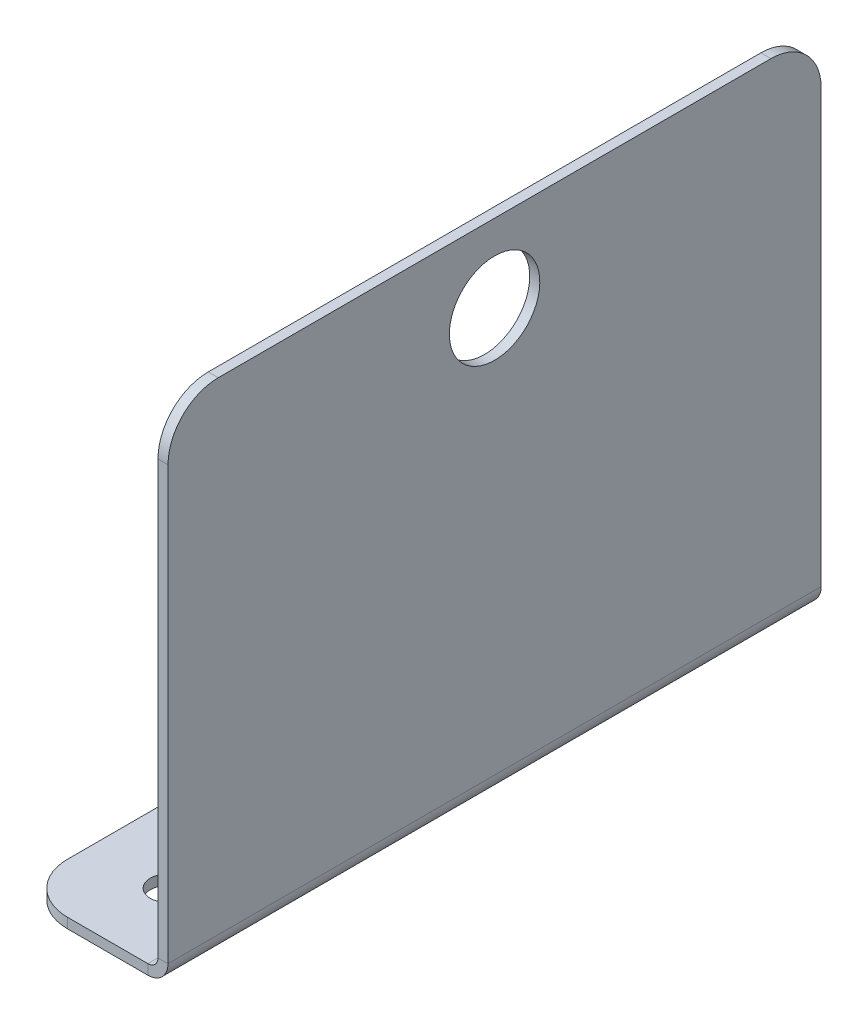
ISO-10303-21;
HEADER;
FILE_DESCRIPTION(('STEP AP214'),'2;1');
FILE_NAME('part.step','',(''),(''),'','','');
FILE_SCHEMA(('AUTOMOTIVE_DESIGN { 1 0 10303 214 1 1 1 1 }'));
ENDSEC;
DATA;
#1=APPLICATION_CONTEXT('core data for automotive mechanical design processes');
#2=APPLICATION_PROTOCOL_DEFINITION('international standard','automotive_design',2000,#1);
#3=PRODUCT_CONTEXT('',#1,'mechanical');
#4=PRODUCT('Part','Part','',(#3));
#5=PRODUCT_RELATED_PRODUCT_CATEGORY('part','',(#4));
#6=PRODUCT_DEFINITION_FORMATION('','',#4);
#7=PRODUCT_DEFINITION_CONTEXT('part definition',#1,'design');
#8=PRODUCT_DEFINITION('design','',#6,#7);
#9=PRODUCT_DEFINITION_SHAPE('','',#8);
#10=(LENGTH_UNIT() NAMED_UNIT(*) SI_UNIT(.MILLI.,.METRE.));
#11=(NAMED_UNIT(*) PLANE_ANGLE_UNIT() SI_UNIT($,.RADIAN.));
#12=(NAMED_UNIT(*) SI_UNIT($,.STERADIAN.) SOLID_ANGLE_UNIT());
#13=UNCERTAINTY_MEASURE_WITH_UNIT(LENGTH_MEASURE(1.E-05),#10,'distance_accuracy_value','');
#14=(GEOMETRIC_REPRESENTATION_CONTEXT(3) GLOBAL_UNCERTAINTY_ASSIGNED_CONTEXT((#13)) GLOBAL_UNIT_ASSIGNED_CONTEXT((#10,
#11,#12)) REPRESENTATION_CONTEXT('',''));
#15=CARTESIAN_POINT('',(0.,0.,0.));
#16=DIRECTION('',(0.,0.,1.));
#17=DIRECTION('',(1.,0.,0.));
#18=AXIS2_PLACEMENT_3D('',#15,#16,#17);
#19=CARTESIAN_POINT('',(-4.,0.,130.));
#20=DIRECTION('',(0.,0.,1.));
#21=DIRECTION('',(1.,0.,0.));
#22=AXIS2_PLACEMENT_3D('',#19,#20,#21);
#23=PLANE('',#22);
#24=DIRECTION('',(0.,1.,0.));
#25=VECTOR('',#24,1.);
#26=CARTESIAN_POINT('',(-4.,0.,130.));
#27=LINE('',#26,#25);
#28=CARTESIAN_POINT('',(-4.,0.,130.));
#29=VERTEX_POINT('',#28);
#30=CARTESIAN_POINT('',(-4.,2.,130.));
#31=VERTEX_POINT('',#30);
#32=EDGE_CURVE('E135',#29,#31,#27,.T.);
#33=ORIENTED_EDGE('',*,*,#32,.F.);
#34=CARTESIAN_POINT('',(-4.,4.,130.));
#35=DIRECTION('',(0.,0.,1.));
#36=DIRECTION('',(1.,0.,0.));
#37=AXIS2_PLACEMENT_3D('',#34,#35,#36);
#38=CIRCLE('',#37,4.);
#39=CARTESIAN_POINT('',(0.,4.,130.));
#40=VERTEX_POINT('',#39);
#41=EDGE_CURVE('E139',#40,#29,#38,.F.);
#42=ORIENTED_EDGE('',*,*,#41,.F.);
#43=DIRECTION('',(1.,0.,0.));
#44=VECTOR('',#43,1.);
#45=CARTESIAN_POINT('',(-2.,4.,130.));
#46=LINE('',#45,#44);
#47=CARTESIAN_POINT('',(-2.,4.,130.));
#48=VERTEX_POINT('',#47);
#49=EDGE_CURVE('E144',#48,#40,#46,.T.);
#50=ORIENTED_EDGE('',*,*,#49,.F.);
#51=CARTESIAN_POINT('',(-4.,4.,130.));
#52=DIRECTION('',(0.,0.,1.));
#53=DIRECTION('',(1.,0.,0.));
#54=AXIS2_PLACEMENT_3D('',#51,#52,#53);
#55=CIRCLE('',#54,2.);
#56=EDGE_CURVE('E141',#48,#31,#55,.F.);
#57=ORIENTED_EDGE('',*,*,#56,.T.);
#58=EDGE_LOOP('',(#33,#42,#50,#57));
#59=FACE_BOUND('',#58,.T.);
#60=ADVANCED_FACE('F41',(#59),#23,.T.);
#61=CARTESIAN_POINT('',(-2.,4.,130.));
#62=DIRECTION('',(0.,0.,1.));
#63=DIRECTION('',(1.,0.,0.));
#64=AXIS2_PLACEMENT_3D('',#61,#62,#63);
#65=PLANE('',#64);
#66=DIRECTION('',(1.,0.,0.));
#67=VECTOR('',#66,1.);
#68=CARTESIAN_POINT('',(0.,2.,130.));
#69=LINE('',#68,#67);
#70=CARTESIAN_POINT('',(-20.,2.,130.));
#71=VERTEX_POINT('',#70);
#72=EDGE_CURVE('E159',#31,#71,#69,.F.);
#73=ORIENTED_EDGE('',*,*,#72,.T.);
#74=DIRECTION('',(0.,1.,0.));
#75=VECTOR('',#74,1.);
#76=CARTESIAN_POINT('',(-20.,4.,130.));
#77=LINE('',#76,#75);
#78=CARTESIAN_POINT('',(-20.,0.,130.));
#79=VERTEX_POINT('',#78);
#80=EDGE_CURVE('E66',#71,#79,#77,.F.);
#81=ORIENTED_EDGE('',*,*,#80,.T.);
#82=DIRECTION('',(-1.,0.,0.));
#83=VECTOR('',#82,1.);
#84=CARTESIAN_POINT('',(0.,0.,130.));
#85=LINE('',#84,#83);
#86=EDGE_CURVE('E149',#29,#79,#85,.T.);
#87=ORIENTED_EDGE('',*,*,#86,.F.);
#88=ORIENTED_EDGE('',*,*,#32,.T.);
#89=EDGE_LOOP('',(#73,#81,#87,#88));
#90=FACE_BOUND('',#89,.T.);
#91=ADVANCED_FACE('F158',(#90),#65,.T.);
#92=CARTESIAN_POINT('',(0.,4.,0.));
#93=DIRECTION('',(0.,0.,-1.));
#94=DIRECTION('',(-1.,0.,0.));
#95=AXIS2_PLACEMENT_3D('',#92,#93,#94);
#96=PLANE('',#95);
#97=DIRECTION('',(-1.,0.,0.));
#98=VECTOR('',#97,1.);
#99=CARTESIAN_POINT('',(0.,4.,0.));
#100=LINE('',#99,#98);
#101=CARTESIAN_POINT('',(0.,4.,0.));
#102=VERTEX_POINT('',#101);
#103=CARTESIAN_POINT('',(-2.,4.,0.));
#104=VERTEX_POINT('',#103);
#105=EDGE_CURVE('E204',#102,#104,#100,.T.);
#106=ORIENTED_EDGE('',*,*,#105,.F.);
#107=CARTESIAN_POINT('',(-4.,4.,0.));
#108=DIRECTION('',(0.,0.,1.));
#109=DIRECTION('',(1.,0.,0.));
#110=AXIS2_PLACEMENT_3D('',#107,#108,#109);
#111=CIRCLE('',#110,4.);
#112=CARTESIAN_POINT('',(-4.,0.,0.));
#113=VERTEX_POINT('',#112);
#114=EDGE_CURVE('E177',#102,#113,#111,.F.);
#115=ORIENTED_EDGE('',*,*,#114,.T.);
#116=DIRECTION('',(0.,-1.,0.));
#117=VECTOR('',#116,1.);
#118=CARTESIAN_POINT('',(-4.,2.,0.));
#119=LINE('',#118,#117);
#120=CARTESIAN_POINT('',(-4.,2.,0.));
#121=VERTEX_POINT('',#120);
#122=EDGE_CURVE('E202',#121,#113,#119,.T.);
#123=ORIENTED_EDGE('',*,*,#122,.F.);
#124=CARTESIAN_POINT('',(-4.,4.,0.));
#125=DIRECTION('',(0.,0.,1.));
#126=DIRECTION('',(1.,0.,0.));
#127=AXIS2_PLACEMENT_3D('',#124,#125,#126);
#128=CIRCLE('',#127,2.);
#129=EDGE_CURVE('E183',#104,#121,#128,.F.);
#130=ORIENTED_EDGE('',*,*,#129,.F.);
#131=EDGE_LOOP('',(#106,#115,#123,#130));
#132=FACE_BOUND('',#131,.T.);
#133=ADVANCED_FACE('F278',(#132),#96,.T.);
#134=CARTESIAN_POINT('',(-4.,2.,0.));
#135=DIRECTION('',(0.,0.,-1.));
#136=DIRECTION('',(-1.,0.,0.));
#137=AXIS2_PLACEMENT_3D('',#134,#135,#136);
#138=PLANE('',#137);
#139=DIRECTION('',(0.,-1.,0.));
#140=VECTOR('',#139,1.);
#141=CARTESIAN_POINT('',(-2.00000000000001,100.,0.));
#142=LINE('',#141,#140);
#143=CARTESIAN_POINT('',(-2.00000000000001,90.,0.));
#144=VERTEX_POINT('',#143);
#145=EDGE_CURVE('E181',#144,#104,#142,.T.);
#146=ORIENTED_EDGE('',*,*,#145,.F.);
#147=DIRECTION('',(1.,0.,0.));
#148=VECTOR('',#147,1.);
#149=CARTESIAN_POINT('',(-4.,90.,0.));
#150=LINE('',#149,#148);
#151=CARTESIAN_POINT('',(0.,90.,0.));
#152=VERTEX_POINT('',#151);
#153=EDGE_CURVE('E143',#144,#152,#150,.T.);
#154=ORIENTED_EDGE('',*,*,#153,.T.);
#155=DIRECTION('',(0.,-1.,0.));
#156=VECTOR('',#155,1.);
#157=CARTESIAN_POINT('',(0.,100.,0.));
#158=LINE('',#157,#156);
#159=EDGE_CURVE('E179',#152,#102,#158,.T.);
#160=ORIENTED_EDGE('',*,*,#159,.T.);
#161=ORIENTED_EDGE('',*,*,#105,.T.);
#162=EDGE_LOOP('',(#146,#154,#160,#161));
#163=FACE_BOUND('',#162,.T.);
#164=ADVANCED_FACE('F295',(#163),#138,.T.);
#165=CARTESIAN_POINT('',(0.,2.,130.));
#166=DIRECTION('',(0.,-1.,0.));
#167=DIRECTION('',(0.,0.,-1.));
#168=AXIS2_PLACEMENT_3D('',#165,#166,#167);
#169=PLANE('',#168);
#170=CARTESIAN_POINT('',(-15.,2.,15.));
#171=DIRECTION('',(0.,1.,0.));
#172=DIRECTION('',(0.,0.,1.));
#173=AXIS2_PLACEMENT_3D('',#170,#171,#172);
#174=CIRCLE('',#173,3.5);
#175=CARTESIAN_POINT('',(-15.,2.,18.5));
#176=VERTEX_POINT('',#175);
#177=EDGE_CURVE('E240',#176,#176,#174,.T.);
#178=ORIENTED_EDGE('',*,*,#177,.F.);
#179=EDGE_LOOP('',(#178));
#180=FACE_BOUND('',#179,.T.);
#181=CARTESIAN_POINT('',(-15.,2.,115.));
#182=DIRECTION('',(0.,1.,0.));
#183=DIRECTION('',(0.,0.,1.));
#184=AXIS2_PLACEMENT_3D('',#181,#182,#183);
#185=CIRCLE('',#184,3.5);
#186=CARTESIAN_POINT('',(-15.,2.,118.5));
#187=VERTEX_POINT('',#186);
#188=EDGE_CURVE('E245',#187,#187,#185,.T.);
#189=ORIENTED_EDGE('',*,*,#188,.F.);
#190=EDGE_LOOP('',(#189));
#191=FACE_BOUND('',#190,.T.);
#192=DIRECTION('',(0.,0.,-1.));
#193=VECTOR('',#192,1.);
#194=CARTESIAN_POINT('',(-30.,2.,130.));
#195=LINE('',#194,#193);
#196=CARTESIAN_POINT('',(-30.,2.,120.));
#197=VERTEX_POINT('',#196);
#198=CARTESIAN_POINT('',(-30.,2.,9.99999999999999));
#199=VERTEX_POINT('',#198);
#200=EDGE_CURVE('E199',#197,#199,#195,.T.);
#201=ORIENTED_EDGE('',*,*,#200,.F.);
#202=CARTESIAN_POINT('',(-20.,2.,120.));
#203=DIRECTION('',(0.,-1.,0.));
#204=DIRECTION('',(0.,0.,-1.));
#205=AXIS2_PLACEMENT_3D('',#202,#203,#204);
#206=CIRCLE('',#205,10.);
#207=EDGE_CURVE('E231',#197,#71,#206,.F.);
#208=ORIENTED_EDGE('',*,*,#207,.T.);
#209=ORIENTED_EDGE('',*,*,#72,.F.);
#210=DIRECTION('',(0.,0.,-1.));
#211=VECTOR('',#210,1.);
#212=CARTESIAN_POINT('',(-4.,2.,130.));
#213=LINE('',#212,#211);
#214=EDGE_CURVE('E172',#31,#121,#213,.T.);
#215=ORIENTED_EDGE('',*,*,#214,.T.);
#216=DIRECTION('',(1.,0.,0.));
#217=VECTOR('',#216,1.);
#218=CARTESIAN_POINT('',(0.,2.,0.));
#219=LINE('',#218,#217);
#220=CARTESIAN_POINT('',(-20.,2.,0.));
#221=VERTEX_POINT('',#220);
#222=EDGE_CURVE('E173',#121,#221,#219,.F.);
#223=ORIENTED_EDGE('',*,*,#222,.T.);
#224=CARTESIAN_POINT('',(-20.,2.,10.));
#225=DIRECTION('',(0.,-1.,0.));
#226=DIRECTION('',(0.,0.,-1.));
#227=AXIS2_PLACEMENT_3D('',#224,#225,#226);
#228=CIRCLE('',#227,10.);
#229=EDGE_CURVE('E229',#221,#199,#228,.F.);
#230=ORIENTED_EDGE('',*,*,#229,.T.);
#231=EDGE_LOOP('',(#201,#208,#209,#215,#223,#230));
#232=FACE_BOUND('',#231,.T.);
#233=ADVANCED_FACE('F271',(#180,#191,#232),#169,.F.);
#234=CARTESIAN_POINT('',(-30.,0.,130.));
#235=DIRECTION('',(-1.,0.,0.));
#236=DIRECTION('',(0.,0.,1.));
#237=AXIS2_PLACEMENT_3D('',#234,#235,#236);
#238=PLANE('',#237);
#239=DIRECTION('',(0.,0.,-1.));
#240=VECTOR('',#239,1.);
#241=CARTESIAN_POINT('',(-30.,0.,130.));
#242=LINE('',#241,#240);
#243=CARTESIAN_POINT('',(-30.,0.,120.));
#244=VERTEX_POINT('',#243);
#245=CARTESIAN_POINT('',(-30.,0.,9.99999999999999));
#246=VERTEX_POINT('',#245);
#247=EDGE_CURVE('E155',#244,#246,#242,.T.);
#248=ORIENTED_EDGE('',*,*,#247,.F.);
#249=DIRECTION('',(0.,1.,0.));
#250=VECTOR('',#249,1.);
#251=CARTESIAN_POINT('',(-30.,0.,120.));
#252=LINE('',#251,#250);
#253=EDGE_CURVE('E226',#244,#197,#252,.T.);
#254=ORIENTED_EDGE('',*,*,#253,.T.);
#255=ORIENTED_EDGE('',*,*,#200,.T.);
#256=DIRECTION('',(0.,1.,0.));
#257=VECTOR('',#256,1.);
#258=CARTESIAN_POINT('',(-30.,0.,10.));
#259=LINE('',#258,#257);
#260=EDGE_CURVE('E224',#199,#246,#259,.F.);
#261=ORIENTED_EDGE('',*,*,#260,.T.);
#262=EDGE_LOOP('',(#248,#254,#255,#261));
#263=FACE_BOUND('',#262,.T.);
#264=ADVANCED_FACE('F262',(#263),#238,.T.);
#265=CARTESIAN_POINT('',(0.,0.,130.));
#266=DIRECTION('',(0.,-1.,0.));
#267=DIRECTION('',(0.,0.,-1.));
#268=AXIS2_PLACEMENT_3D('',#265,#266,#267);
#269=PLANE('',#268);
#270=CARTESIAN_POINT('',(-15.,0.,15.));
#271=DIRECTION('',(0.,-1.,0.));
#272=DIRECTION('',(0.,0.,-1.));
#273=AXIS2_PLACEMENT_3D('',#270,#271,#272);
#274=CIRCLE('',#273,3.5);
#275=CARTESIAN_POINT('',(-15.,0.,11.5));
#276=VERTEX_POINT('',#275);
#277=EDGE_CURVE('E45',#276,#276,#274,.T.);
#278=ORIENTED_EDGE('',*,*,#277,.F.);
#279=EDGE_LOOP('',(#278));
#280=FACE_BOUND('',#279,.T.);
#281=CARTESIAN_POINT('',(-15.,0.,115.));
#282=DIRECTION('',(0.,-1.,0.));
#283=DIRECTION('',(0.,0.,-1.));
#284=AXIS2_PLACEMENT_3D('',#281,#282,#283);
#285=CIRCLE('',#284,3.5);
#286=CARTESIAN_POINT('',(-15.,0.,111.5));
#287=VERTEX_POINT('',#286);
#288=EDGE_CURVE('E238',#287,#287,#285,.T.);
#289=ORIENTED_EDGE('',*,*,#288,.F.);
#290=EDGE_LOOP('',(#289));
#291=FACE_BOUND('',#290,.T.);
#292=ORIENTED_EDGE('',*,*,#86,.T.);
#293=CARTESIAN_POINT('',(-20.,0.,120.));
#294=DIRECTION('',(0.,-1.,0.));
#295=DIRECTION('',(0.,0.,-1.));
#296=AXIS2_PLACEMENT_3D('',#293,#294,#295);
#297=CIRCLE('',#296,10.);
#298=EDGE_CURVE('E235',#79,#244,#297,.T.);
#299=ORIENTED_EDGE('',*,*,#298,.T.);
#300=ORIENTED_EDGE('',*,*,#247,.T.);
#301=CARTESIAN_POINT('',(-20.,0.,10.));
#302=DIRECTION('',(0.,-1.,0.));
#303=DIRECTION('',(0.,0.,-1.));
#304=AXIS2_PLACEMENT_3D('',#301,#302,#303);
#305=CIRCLE('',#304,10.);
#306=CARTESIAN_POINT('',(-20.,0.,0.));
#307=VERTEX_POINT('',#306);
#308=EDGE_CURVE('E58',#246,#307,#305,.T.);
#309=ORIENTED_EDGE('',*,*,#308,.T.);
#310=DIRECTION('',(-1.,0.,0.));
#311=VECTOR('',#310,1.);
#312=CARTESIAN_POINT('',(0.,0.,0.));
#313=LINE('',#312,#311);
#314=EDGE_CURVE('E151',#113,#307,#313,.T.);
#315=ORIENTED_EDGE('',*,*,#314,.F.);
#316=DIRECTION('',(0.,0.,-1.));
#317=VECTOR('',#316,1.);
#318=CARTESIAN_POINT('',(-4.,0.,130.));
#319=LINE('',#318,#317);
#320=EDGE_CURVE('E147',#29,#113,#319,.T.);
#321=ORIENTED_EDGE('',*,*,#320,.F.);
#322=EDGE_LOOP('',(#292,#299,#300,#309,#315,#321));
#323=FACE_BOUND('',#322,.T.);
#324=ADVANCED_FACE('F148',(#280,#291,#323),#269,.T.);
#325=CARTESIAN_POINT('',(-4.,4.,130.));
#326=DIRECTION('',(0.,0.,-1.));
#327=DIRECTION('',(-1.,0.,0.));
#328=AXIS2_PLACEMENT_3D('',#325,#326,#327);
#329=CYLINDRICAL_SURFACE('',#328,4.);
#330=ORIENTED_EDGE('',*,*,#114,.F.);
#331=DIRECTION('',(0.,0.,-1.));
#332=VECTOR('',#331,1.);
#333=CARTESIAN_POINT('',(0.,4.,130.));
#334=LINE('',#333,#332);
#335=EDGE_CURVE('E156',#40,#102,#334,.T.);
#336=ORIENTED_EDGE('',*,*,#335,.F.);
#337=ORIENTED_EDGE('',*,*,#41,.T.);
#338=ORIENTED_EDGE('',*,*,#320,.T.);
#339=EDGE_LOOP('',(#330,#336,#337,#338));
#340=FACE_BOUND('',#339,.T.);
#341=ADVANCED_FACE('F162',(#340),#329,.T.);
#342=CARTESIAN_POINT('',(0.,100.,130.));
#343=DIRECTION('',(1.,0.,0.));
#344=DIRECTION('',(0.,1.,0.));
#345=AXIS2_PLACEMENT_3D('',#342,#343,#344);
#346=PLANE('',#345);
#347=CARTESIAN_POINT('',(0.,84.4999999971944,65.));
#348=DIRECTION('',(1.,0.,0.));
#349=DIRECTION('',(0.,1.,0.));
#350=AXIS2_PLACEMENT_3D('',#347,#348,#349);
#351=CIRCLE('',#350,9.00000000000001);
#352=CARTESIAN_POINT('',(0.,93.4999999971944,65.));
#353=VERTEX_POINT('',#352);
#354=EDGE_CURVE('E253',#353,#353,#351,.T.);
#355=ORIENTED_EDGE('',*,*,#354,.F.);
#356=EDGE_LOOP('',(#355));
#357=FACE_BOUND('',#356,.T.);
#358=ORIENTED_EDGE('',*,*,#159,.F.);
#359=CARTESIAN_POINT('',(0.,90.,10.));
#360=DIRECTION('',(1.,0.,0.));
#361=DIRECTION('',(0.,1.,0.));
#362=AXIS2_PLACEMENT_3D('',#359,#360,#361);
#363=CIRCLE('',#362,10.);
#364=CARTESIAN_POINT('',(0.,100.,9.99999999999999));
#365=VERTEX_POINT('',#364);
#366=EDGE_CURVE('E213',#152,#365,#363,.T.);
#367=ORIENTED_EDGE('',*,*,#366,.T.);
#368=DIRECTION('',(0.,0.,-1.));
#369=VECTOR('',#368,1.);
#370=CARTESIAN_POINT('',(0.,100.,130.));
#371=LINE('',#370,#369);
#372=CARTESIAN_POINT('',(0.,100.,120.));
#373=VERTEX_POINT('',#372);
#374=EDGE_CURVE('E194',#373,#365,#371,.T.);
#375=ORIENTED_EDGE('',*,*,#374,.F.);
#376=CARTESIAN_POINT('',(0.,90.,120.));
#377=DIRECTION('',(1.,0.,0.));
#378=DIRECTION('',(0.,1.,0.));
#379=AXIS2_PLACEMENT_3D('',#376,#377,#378);
#380=CIRCLE('',#379,10.);
#381=CARTESIAN_POINT('',(0.,90.,130.));
#382=VERTEX_POINT('',#381);
#383=EDGE_CURVE('E211',#373,#382,#380,.T.);
#384=ORIENTED_EDGE('',*,*,#383,.T.);
#385=DIRECTION('',(0.,-1.,0.));
#386=VECTOR('',#385,1.);
#387=CARTESIAN_POINT('',(0.,100.,130.));
#388=LINE('',#387,#386);
#389=EDGE_CURVE('E164',#382,#40,#388,.T.);
#390=ORIENTED_EDGE('',*,*,#389,.T.);
#391=ORIENTED_EDGE('',*,*,#335,.T.);
#392=EDGE_LOOP('',(#358,#367,#375,#384,#390,#391));
#393=FACE_BOUND('',#392,.T.);
#394=ADVANCED_FACE('F283',(#357,#393),#346,.T.);
#395=CARTESIAN_POINT('',(-2.00000000000001,100.,130.));
#396=DIRECTION('',(0.,1.,0.));
#397=DIRECTION('',(0.,0.,1.));
#398=AXIS2_PLACEMENT_3D('',#395,#396,#397);
#399=PLANE('',#398);
#400=ORIENTED_EDGE('',*,*,#374,.T.);
#401=DIRECTION('',(1.,0.,0.));
#402=VECTOR('',#401,1.);
#403=CARTESIAN_POINT('',(-2.00000000000001,100.,9.99999999999999));
#404=LINE('',#403,#402);
#405=CARTESIAN_POINT('',(-2.00000000000001,100.,9.99999999999999));
#406=VERTEX_POINT('',#405);
#407=EDGE_CURVE('E218',#365,#406,#404,.F.);
#408=ORIENTED_EDGE('',*,*,#407,.T.);
#409=DIRECTION('',(0.,0.,-1.));
#410=VECTOR('',#409,1.);
#411=CARTESIAN_POINT('',(-2.00000000000001,100.,130.));
#412=LINE('',#411,#410);
#413=CARTESIAN_POINT('',(-2.00000000000001,100.,120.));
#414=VERTEX_POINT('',#413);
#415=EDGE_CURVE('E191',#414,#406,#412,.T.);
#416=ORIENTED_EDGE('',*,*,#415,.F.);
#417=DIRECTION('',(1.,0.,0.));
#418=VECTOR('',#417,1.);
#419=CARTESIAN_POINT('',(-2.00000000000001,100.,120.));
#420=LINE('',#419,#418);
#421=EDGE_CURVE('E215',#414,#373,#420,.T.);
#422=ORIENTED_EDGE('',*,*,#421,.T.);
#423=EDGE_LOOP('',(#400,#408,#416,#422));
#424=FACE_BOUND('',#423,.T.);
#425=ADVANCED_FACE('F300',(#424),#399,.T.);
#426=CARTESIAN_POINT('',(-2.00000000000001,100.,130.));
#427=DIRECTION('',(1.,0.,0.));
#428=DIRECTION('',(0.,1.,0.));
#429=AXIS2_PLACEMENT_3D('',#426,#427,#428);
#430=PLANE('',#429);
#431=CARTESIAN_POINT('',(-2.,84.4999999971944,65.));
#432=DIRECTION('',(1.,0.,0.));
#433=DIRECTION('',(0.,1.,0.));
#434=AXIS2_PLACEMENT_3D('',#431,#432,#433);
#435=CIRCLE('',#434,9.00000000000001);
#436=CARTESIAN_POINT('',(-2.00000000000001,93.4999999971944,65.));
#437=VERTEX_POINT('',#436);
#438=EDGE_CURVE('E250',#437,#437,#435,.T.);
#439=ORIENTED_EDGE('',*,*,#438,.T.);
#440=EDGE_LOOP('',(#439));
#441=FACE_BOUND('',#440,.T.);
#442=ORIENTED_EDGE('',*,*,#415,.T.);
#443=CARTESIAN_POINT('',(-2.00000000000001,90.,10.));
#444=DIRECTION('',(1.,0.,0.));
#445=DIRECTION('',(0.,1.,0.));
#446=AXIS2_PLACEMENT_3D('',#443,#444,#445);
#447=CIRCLE('',#446,10.);
#448=EDGE_CURVE('E222',#406,#144,#447,.F.);
#449=ORIENTED_EDGE('',*,*,#448,.T.);
#450=ORIENTED_EDGE('',*,*,#145,.T.);
#451=DIRECTION('',(0.,0.,-1.));
#452=VECTOR('',#451,1.);
#453=CARTESIAN_POINT('',(-2.,4.,130.));
#454=LINE('',#453,#452);
#455=EDGE_CURVE('E188',#48,#104,#454,.T.);
#456=ORIENTED_EDGE('',*,*,#455,.F.);
#457=DIRECTION('',(0.,-1.,0.));
#458=VECTOR('',#457,1.);
#459=CARTESIAN_POINT('',(-2.00000000000001,100.,130.));
#460=LINE('',#459,#458);
#461=CARTESIAN_POINT('',(-2.00000000000001,90.,130.));
#462=VERTEX_POINT('',#461);
#463=EDGE_CURVE('E166',#462,#48,#460,.T.);
#464=ORIENTED_EDGE('',*,*,#463,.F.);
#465=CARTESIAN_POINT('',(-2.00000000000001,90.,120.));
#466=DIRECTION('',(1.,0.,0.));
#467=DIRECTION('',(0.,1.,0.));
#468=AXIS2_PLACEMENT_3D('',#465,#466,#467);
#469=CIRCLE('',#468,10.);
#470=EDGE_CURVE('E220',#462,#414,#469,.F.);
#471=ORIENTED_EDGE('',*,*,#470,.T.);
#472=EDGE_LOOP('',(#442,#449,#450,#456,#464,#471));
#473=FACE_BOUND('',#472,.T.);
#474=ADVANCED_FACE('F291',(#441,#473),#430,.F.);
#475=CARTESIAN_POINT('',(-4.,4.,130.));
#476=DIRECTION('',(0.,0.,-1.));
#477=DIRECTION('',(-1.,0.,0.));
#478=AXIS2_PLACEMENT_3D('',#475,#476,#477);
#479=CYLINDRICAL_SURFACE('',#478,2.);
#480=ORIENTED_EDGE('',*,*,#129,.T.);
#481=ORIENTED_EDGE('',*,*,#214,.F.);
#482=ORIENTED_EDGE('',*,*,#56,.F.);
#483=ORIENTED_EDGE('',*,*,#455,.T.);
#484=EDGE_LOOP('',(#480,#481,#482,#483));
#485=FACE_BOUND('',#484,.T.);
#486=ADVANCED_FACE('F273',(#485),#479,.F.);
#487=CARTESIAN_POINT('',(-4.,4.,130.));
#488=DIRECTION('',(0.,0.,1.));
#489=DIRECTION('',(1.,0.,0.));
#490=AXIS2_PLACEMENT_3D('',#487,#488,#489);
#491=PLANE('',#490);
#492=ORIENTED_EDGE('',*,*,#389,.F.);
#493=DIRECTION('',(1.,0.,0.));
#494=VECTOR('',#493,1.);
#495=CARTESIAN_POINT('',(-4.,90.,130.));
#496=LINE('',#495,#494);
#497=EDGE_CURVE('E11',#382,#462,#496,.F.);
#498=ORIENTED_EDGE('',*,*,#497,.T.);
#499=ORIENTED_EDGE('',*,*,#463,.T.);
#500=ORIENTED_EDGE('',*,*,#49,.T.);
#501=EDGE_LOOP('',(#492,#498,#499,#500));
#502=FACE_BOUND('',#501,.T.);
#503=ADVANCED_FACE('F288',(#502),#491,.T.);
#504=CARTESIAN_POINT('',(-4.,4.,0.));
#505=DIRECTION('',(0.,0.,1.));
#506=DIRECTION('',(1.,0.,0.));
#507=AXIS2_PLACEMENT_3D('',#504,#505,#506);
#508=PLANE('',#507);
#509=ORIENTED_EDGE('',*,*,#314,.T.);
#510=DIRECTION('',(0.,1.,0.));
#511=VECTOR('',#510,1.);
#512=CARTESIAN_POINT('',(-20.,2.,0.));
#513=LINE('',#512,#511);
#514=EDGE_CURVE('E50',#307,#221,#513,.T.);
#515=ORIENTED_EDGE('',*,*,#514,.T.);
#516=ORIENTED_EDGE('',*,*,#222,.F.);
#517=ORIENTED_EDGE('',*,*,#122,.T.);
#518=EDGE_LOOP('',(#509,#515,#516,#517));
#519=FACE_BOUND('',#518,.T.);
#520=ADVANCED_FACE('F270',(#519),#508,.F.);
#521=CARTESIAN_POINT('',(-4.,90.,10.));
#522=DIRECTION('',(1.,0.,0.));
#523=DIRECTION('',(0.,0.,-1.));
#524=AXIS2_PLACEMENT_3D('',#521,#522,#523);
#525=CYLINDRICAL_SURFACE('',#524,10.);
#526=ORIENTED_EDGE('',*,*,#448,.F.);
#527=ORIENTED_EDGE('',*,*,#407,.F.);
#528=ORIENTED_EDGE('',*,*,#366,.F.);
#529=ORIENTED_EDGE('',*,*,#153,.F.);
#530=EDGE_LOOP('',(#526,#527,#528,#529));
#531=FACE_BOUND('',#530,.T.);
#532=ADVANCED_FACE('F297',(#531),#525,.T.);
#533=CARTESIAN_POINT('',(-20.,0.,120.));
#534=DIRECTION('',(0.,1.,0.));
#535=DIRECTION('',(0.,0.,1.));
#536=AXIS2_PLACEMENT_3D('',#533,#534,#535);
#537=CYLINDRICAL_SURFACE('',#536,10.);
#538=ORIENTED_EDGE('',*,*,#298,.F.);
#539=ORIENTED_EDGE('',*,*,#80,.F.);
#540=ORIENTED_EDGE('',*,*,#207,.F.);
#541=ORIENTED_EDGE('',*,*,#253,.F.);
#542=EDGE_LOOP('',(#538,#539,#540,#541));
#543=FACE_BOUND('',#542,.T.);
#544=ADVANCED_FACE('F258',(#543),#537,.T.);
#545=CARTESIAN_POINT('',(-20.,4.,10.));
#546=DIRECTION('',(0.,-1.,0.));
#547=DIRECTION('',(0.,0.,-1.));
#548=AXIS2_PLACEMENT_3D('',#545,#546,#547);
#549=CYLINDRICAL_SURFACE('',#548,10.);
#550=ORIENTED_EDGE('',*,*,#308,.F.);
#551=ORIENTED_EDGE('',*,*,#260,.F.);
#552=ORIENTED_EDGE('',*,*,#229,.F.);
#553=ORIENTED_EDGE('',*,*,#514,.F.);
#554=EDGE_LOOP('',(#550,#551,#552,#553));
#555=FACE_BOUND('',#554,.T.);
#556=ADVANCED_FACE('F266',(#555),#549,.T.);
#557=CARTESIAN_POINT('',(-2.00000000000001,90.,120.));
#558=DIRECTION('',(1.,0.,0.));
#559=DIRECTION('',(0.,0.,-1.));
#560=AXIS2_PLACEMENT_3D('',#557,#558,#559);
#561=CYLINDRICAL_SURFACE('',#560,10.);
#562=ORIENTED_EDGE('',*,*,#470,.F.);
#563=ORIENTED_EDGE('',*,*,#497,.F.);
#564=ORIENTED_EDGE('',*,*,#383,.F.);
#565=ORIENTED_EDGE('',*,*,#421,.F.);
#566=EDGE_LOOP('',(#562,#563,#564,#565));
#567=FACE_BOUND('',#566,.T.);
#568=ADVANCED_FACE('F43',(#567),#561,.T.);
#569=CARTESIAN_POINT('',(-15.,-8.,115.));
#570=DIRECTION('',(0.,1.,0.));
#571=DIRECTION('',(0.,0.,1.));
#572=AXIS2_PLACEMENT_3D('',#569,#570,#571);
#573=CYLINDRICAL_SURFACE('',#572,3.5);
#574=ORIENTED_EDGE('',*,*,#288,.T.);
#575=EDGE_LOOP('',(#574));
#576=FACE_BOUND('',#575,.T.);
#577=ORIENTED_EDGE('',*,*,#188,.T.);
#578=EDGE_LOOP('',(#577));
#579=FACE_BOUND('',#578,.T.);
#580=ADVANCED_FACE('F305',(#576,#579),#573,.F.);
#581=CARTESIAN_POINT('',(-15.,-8.,15.));
#582=DIRECTION('',(0.,1.,0.));
#583=DIRECTION('',(0.,0.,1.));
#584=AXIS2_PLACEMENT_3D('',#581,#582,#583);
#585=CYLINDRICAL_SURFACE('',#584,3.5);
#586=ORIENTED_EDGE('',*,*,#277,.T.);
#587=EDGE_LOOP('',(#586));
#588=FACE_BOUND('',#587,.T.);
#589=ORIENTED_EDGE('',*,*,#177,.T.);
#590=EDGE_LOOP('',(#589));
#591=FACE_BOUND('',#590,.T.);
#592=ADVANCED_FACE('F310',(#588,#591),#585,.F.);
#593=CARTESIAN_POINT('',(-2.,84.4999999971944,65.));
#594=DIRECTION('',(1.,0.,0.));
#595=DIRECTION('',(0.,1.,0.));
#596=AXIS2_PLACEMENT_3D('',#593,#594,#595);
#597=CYLINDRICAL_SURFACE('',#596,9.00000000000001);
#598=ORIENTED_EDGE('',*,*,#438,.F.);
#599=EDGE_LOOP('',(#598));
#600=FACE_BOUND('',#599,.T.);
#601=ORIENTED_EDGE('',*,*,#354,.T.);
#602=EDGE_LOOP('',(#601));
#603=FACE_BOUND('',#602,.T.);
#604=ADVANCED_FACE('F380',(#600,#603),#597,.F.);
#605=CLOSED_SHELL('',(#60,#91,#133,#164,#233,#264,#324,#341,#394,#425,#474,#486,#503,#520,#532,
#544,#556,#568,#580,#592,#604));
#606=MANIFOLD_SOLID_BREP('B2',#605);
#607=ADVANCED_BREP_SHAPE_REPRESENTATION('',(#18,#606),#14);
#608=SHAPE_DEFINITION_REPRESENTATION(#9,#607);
ENDSEC;
END-ISO-10303-21;
